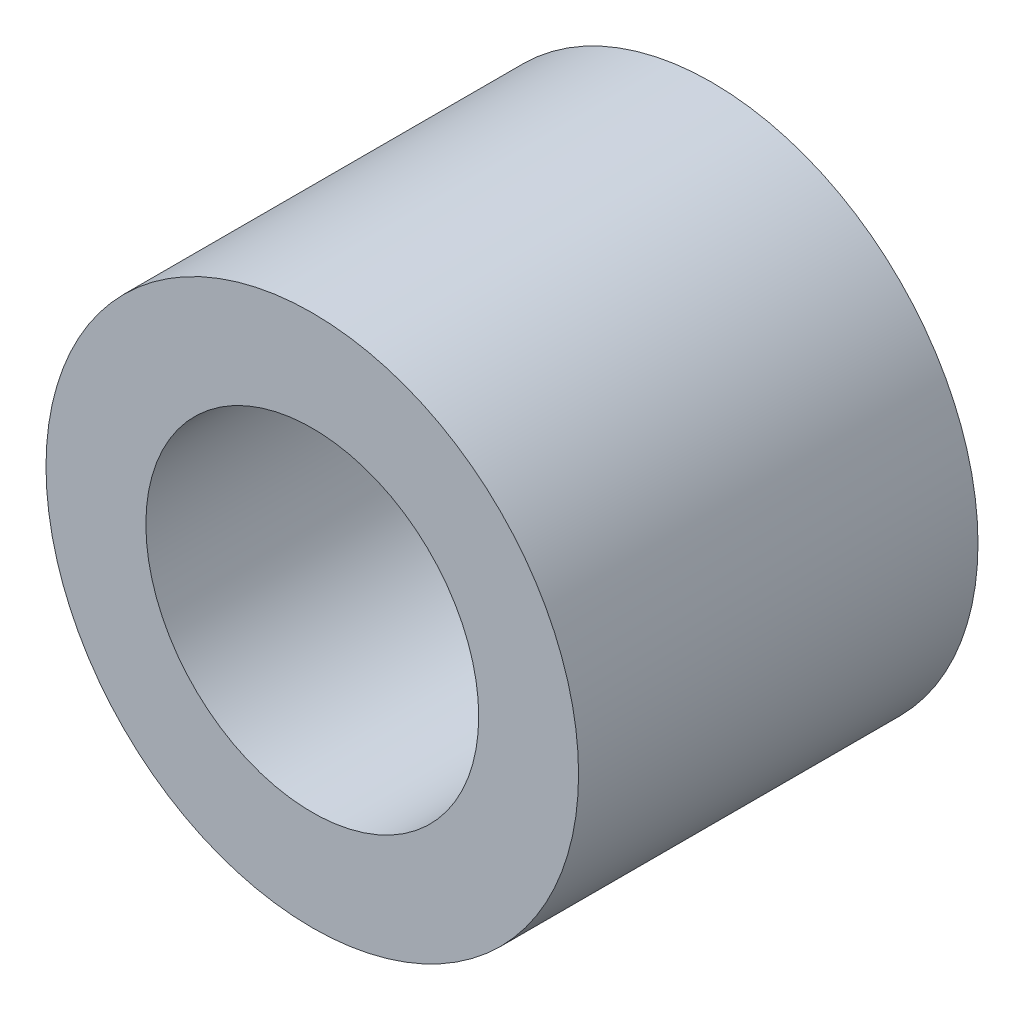
ISO-10303-21;
HEADER;
FILE_DESCRIPTION(('STEP AP214'),'2;1');
FILE_NAME('part.step','',(''),(''),'','','');
FILE_SCHEMA(('AUTOMOTIVE_DESIGN { 1 0 10303 214 1 1 1 1 }'));
ENDSEC;
DATA;
#1=APPLICATION_CONTEXT('core data for automotive mechanical design processes');
#2=APPLICATION_PROTOCOL_DEFINITION('international standard','automotive_design',2000,#1);
#3=PRODUCT_CONTEXT('',#1,'mechanical');
#4=PRODUCT('Part','Part','',(#3));
#5=PRODUCT_RELATED_PRODUCT_CATEGORY('part','',(#4));
#6=PRODUCT_DEFINITION_FORMATION('','',#4);
#7=PRODUCT_DEFINITION_CONTEXT('part definition',#1,'design');
#8=PRODUCT_DEFINITION('design','',#6,#7);
#9=PRODUCT_DEFINITION_SHAPE('','',#8);
#10=(LENGTH_UNIT() NAMED_UNIT(*) SI_UNIT(.MILLI.,.METRE.));
#11=(NAMED_UNIT(*) PLANE_ANGLE_UNIT() SI_UNIT($,.RADIAN.));
#12=(NAMED_UNIT(*) SI_UNIT($,.STERADIAN.) SOLID_ANGLE_UNIT());
#13=UNCERTAINTY_MEASURE_WITH_UNIT(LENGTH_MEASURE(1.E-05),#10,'distance_accuracy_value','');
#14=(GEOMETRIC_REPRESENTATION_CONTEXT(3) GLOBAL_UNCERTAINTY_ASSIGNED_CONTEXT((#13)) GLOBAL_UNIT_ASSIGNED_CONTEXT((#10,
#11,#12)) REPRESENTATION_CONTEXT('',''));
#15=CARTESIAN_POINT('',(0.,0.,0.));
#16=DIRECTION('',(0.,0.,1.));
#17=DIRECTION('',(1.,0.,0.));
#18=AXIS2_PLACEMENT_3D('',#15,#16,#17);
#19=CARTESIAN_POINT('',(0.,0.,12.));
#20=DIRECTION('',(0.,0.,1.));
#21=DIRECTION('',(1.,0.,0.));
#22=AXIS2_PLACEMENT_3D('',#19,#20,#21);
#23=PLANE('',#22);
#24=CARTESIAN_POINT('',(0.,0.,12.));
#25=DIRECTION('',(0.,0.,1.));
#26=DIRECTION('',(1.,0.,0.));
#27=AXIS2_PLACEMENT_3D('',#24,#25,#26);
#28=CIRCLE('',#27,8.);
#29=CARTESIAN_POINT('',(8.,0.,12.));
#30=VERTEX_POINT('',#29);
#31=EDGE_CURVE('E10',#30,#30,#28,.T.);
#32=ORIENTED_EDGE('',*,*,#31,.T.);
#33=EDGE_LOOP('',(#32));
#34=FACE_BOUND('',#33,.T.);
#35=CARTESIAN_POINT('',(0.,0.,12.));
#36=DIRECTION('',(0.,0.,1.));
#37=DIRECTION('',(1.,0.,0.));
#38=AXIS2_PLACEMENT_3D('',#35,#36,#37);
#39=CIRCLE('',#38,5.);
#40=CARTESIAN_POINT('',(5.,0.,12.));
#41=VERTEX_POINT('',#40);
#42=EDGE_CURVE('E41',#41,#41,#39,.T.);
#43=ORIENTED_EDGE('',*,*,#42,.F.);
#44=EDGE_LOOP('',(#43));
#45=FACE_BOUND('',#44,.T.);
#46=ADVANCED_FACE('F30',(#34,#45),#23,.T.);
#47=CARTESIAN_POINT('',(0.,0.,0.));
#48=DIRECTION('',(0.,0.,1.));
#49=DIRECTION('',(1.,0.,0.));
#50=AXIS2_PLACEMENT_3D('',#47,#48,#49);
#51=PLANE('',#50);
#52=CARTESIAN_POINT('',(0.,0.,0.));
#53=DIRECTION('',(0.,0.,1.));
#54=DIRECTION('',(1.,0.,0.));
#55=AXIS2_PLACEMENT_3D('',#52,#53,#54);
#56=CIRCLE('',#55,8.);
#57=CARTESIAN_POINT('',(8.,0.,0.));
#58=VERTEX_POINT('',#57);
#59=EDGE_CURVE('E34',#58,#58,#56,.T.);
#60=ORIENTED_EDGE('',*,*,#59,.F.);
#61=EDGE_LOOP('',(#60));
#62=FACE_BOUND('',#61,.T.);
#63=CARTESIAN_POINT('',(0.,0.,0.));
#64=DIRECTION('',(0.,0.,1.));
#65=DIRECTION('',(1.,0.,0.));
#66=AXIS2_PLACEMENT_3D('',#63,#64,#65);
#67=CIRCLE('',#66,5.);
#68=CARTESIAN_POINT('',(5.,0.,0.));
#69=VERTEX_POINT('',#68);
#70=EDGE_CURVE('E43',#69,#69,#67,.T.);
#71=ORIENTED_EDGE('',*,*,#70,.T.);
#72=EDGE_LOOP('',(#71));
#73=FACE_BOUND('',#72,.T.);
#74=ADVANCED_FACE('F53',(#62,#73),#51,.F.);
#75=CARTESIAN_POINT('',(0.,0.,12.));
#76=DIRECTION('',(0.,0.,-1.));
#77=DIRECTION('',(-1.,0.,0.));
#78=AXIS2_PLACEMENT_3D('',#75,#76,#77);
#79=CYLINDRICAL_SURFACE('',#78,8.);
#80=ORIENTED_EDGE('',*,*,#31,.F.);
#81=EDGE_LOOP('',(#80));
#82=FACE_BOUND('',#81,.T.);
#83=ORIENTED_EDGE('',*,*,#59,.T.);
#84=EDGE_LOOP('',(#83));
#85=FACE_BOUND('',#84,.T.);
#86=ADVANCED_FACE('F32',(#82,#85),#79,.T.);
#87=CARTESIAN_POINT('',(0.,0.,12.));
#88=DIRECTION('',(0.,0.,-1.));
#89=DIRECTION('',(-1.,0.,0.));
#90=AXIS2_PLACEMENT_3D('',#87,#88,#89);
#91=CYLINDRICAL_SURFACE('',#90,5.);
#92=ORIENTED_EDGE('',*,*,#42,.T.);
#93=EDGE_LOOP('',(#92));
#94=FACE_BOUND('',#93,.T.);
#95=ORIENTED_EDGE('',*,*,#70,.F.);
#96=EDGE_LOOP('',(#95));
#97=FACE_BOUND('',#96,.T.);
#98=ADVANCED_FACE('F49',(#94,#97),#91,.F.);
#99=CLOSED_SHELL('',(#46,#74,#86,#98));
#100=MANIFOLD_SOLID_BREP('B2',#99);
#101=ADVANCED_BREP_SHAPE_REPRESENTATION('',(#18,#100),#14);
#102=SHAPE_DEFINITION_REPRESENTATION(#9,#101);
ENDSEC;
END-ISO-10303-21;
